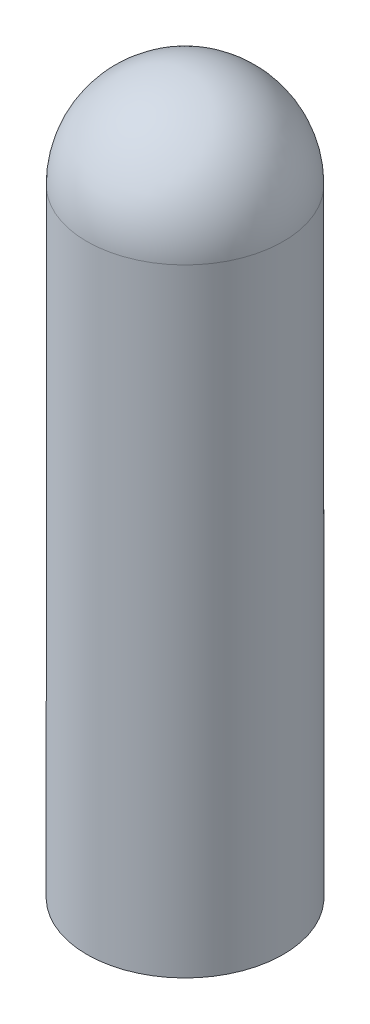
ISO-10303-21;
HEADER;
FILE_DESCRIPTION(('STEP AP214'),'2;1');
FILE_NAME('part.step','',(''),(''),'','','');
FILE_SCHEMA(('AUTOMOTIVE_DESIGN { 1 0 10303 214 1 1 1 1 }'));
ENDSEC;
DATA;
#1=APPLICATION_CONTEXT('core data for automotive mechanical design processes');
#2=APPLICATION_PROTOCOL_DEFINITION('international standard','automotive_design',2000,#1);
#3=PRODUCT_CONTEXT('',#1,'mechanical');
#4=PRODUCT('Part','Part','',(#3));
#5=PRODUCT_RELATED_PRODUCT_CATEGORY('part','',(#4));
#6=PRODUCT_DEFINITION_FORMATION('','',#4);
#7=PRODUCT_DEFINITION_CONTEXT('part definition',#1,'design');
#8=PRODUCT_DEFINITION('design','',#6,#7);
#9=PRODUCT_DEFINITION_SHAPE('','',#8);
#10=(LENGTH_UNIT() NAMED_UNIT(*) SI_UNIT(.MILLI.,.METRE.));
#11=(NAMED_UNIT(*) PLANE_ANGLE_UNIT() SI_UNIT($,.RADIAN.));
#12=(NAMED_UNIT(*) SI_UNIT($,.STERADIAN.) SOLID_ANGLE_UNIT());
#13=UNCERTAINTY_MEASURE_WITH_UNIT(LENGTH_MEASURE(1.E-05),#10,'distance_accuracy_value','');
#14=(GEOMETRIC_REPRESENTATION_CONTEXT(3) GLOBAL_UNCERTAINTY_ASSIGNED_CONTEXT((#13)) GLOBAL_UNIT_ASSIGNED_CONTEXT((#10,
#11,#12)) REPRESENTATION_CONTEXT('',''));
#15=CARTESIAN_POINT('',(0.,0.,0.));
#16=DIRECTION('',(0.,0.,1.));
#17=DIRECTION('',(1.,0.,0.));
#18=AXIS2_PLACEMENT_3D('',#15,#16,#17);
#19=CARTESIAN_POINT('',(-4.3561,0.,0.));
#20=DIRECTION('',(0.,-1.,0.));
#21=DIRECTION('',(0.,0.,-1.));
#22=AXIS2_PLACEMENT_3D('',#19,#20,#21);
#23=PLANE('',#22);
#24=CARTESIAN_POINT('',(0.,0.,0.));
#25=DIRECTION('',(0.,-1.,0.));
#26=DIRECTION('',(0.,0.,-1.));
#27=AXIS2_PLACEMENT_3D('',#24,#25,#26);
#28=CIRCLE('',#27,3.9751);
#29=CARTESIAN_POINT('',(0.,0.,-3.9751));
#30=VERTEX_POINT('',#29);
#31=EDGE_CURVE('E43',#30,#30,#28,.T.);
#32=ORIENTED_EDGE('',*,*,#31,.F.);
#33=EDGE_LOOP('',(#32));
#34=FACE_BOUND('',#33,.T.);
#35=CARTESIAN_POINT('',(0.,0.,0.));
#36=DIRECTION('',(0.,1.,0.));
#37=DIRECTION('',(0.,0.,1.));
#38=AXIS2_PLACEMENT_3D('',#35,#36,#37);
#39=CIRCLE('',#38,4.3561);
#40=CARTESIAN_POINT('',(0.,0.,4.3561));
#41=VERTEX_POINT('',#40);
#42=EDGE_CURVE('E10',#41,#41,#39,.T.);
#43=ORIENTED_EDGE('',*,*,#42,.F.);
#44=EDGE_LOOP('',(#43));
#45=FACE_BOUND('',#44,.T.);
#46=ADVANCED_FACE('F29',(#34,#45),#23,.T.);
#47=CARTESIAN_POINT('',(0.,0.,0.));
#48=DIRECTION('',(0.,1.,0.));
#49=DIRECTION('',(0.,0.,1.));
#50=AXIS2_PLACEMENT_3D('',#47,#48,#49);
#51=CYLINDRICAL_SURFACE('',#50,4.3561);
#52=ORIENTED_EDGE('',*,*,#42,.T.);
#53=EDGE_LOOP('',(#52));
#54=FACE_BOUND('',#53,.T.);
#55=CARTESIAN_POINT('',(0.,27.3939,0.));
#56=DIRECTION('',(0.,1.,0.));
#57=DIRECTION('',(0.,0.,1.));
#58=AXIS2_PLACEMENT_3D('',#55,#56,#57);
#59=CIRCLE('',#58,4.3561);
#60=CARTESIAN_POINT('',(0.,27.3939,4.3561));
#61=VERTEX_POINT('',#60);
#62=EDGE_CURVE('E35',#61,#61,#59,.T.);
#63=ORIENTED_EDGE('',*,*,#62,.F.);
#64=EDGE_LOOP('',(#63));
#65=FACE_BOUND('',#64,.T.);
#66=ADVANCED_FACE('F53',(#54,#65),#51,.T.);
#67=CARTESIAN_POINT('',(0.,27.3939,0.));
#68=DIRECTION('',(0.,1.,0.));
#69=DIRECTION('',(-1.,0.,0.));
#70=AXIS2_PLACEMENT_3D('',#67,#68,#69);
#71=SPHERICAL_SURFACE('',#70,4.3561);
#72=ORIENTED_EDGE('',*,*,#62,.T.);
#73=EDGE_LOOP('',(#72));
#74=FACE_BOUND('',#73,.T.);
#75=ADVANCED_FACE('F57',(#74),#71,.T.);
#76=CARTESIAN_POINT('',(0.,27.7749,0.));
#77=DIRECTION('',(0.,-1.,0.));
#78=DIRECTION('',(0.,0.,-1.));
#79=AXIS2_PLACEMENT_3D('',#76,#77,#78);
#80=CYLINDRICAL_SURFACE('',#79,3.9751);
#81=CARTESIAN_POINT('',(0.,27.7749,0.));
#82=DIRECTION('',(0.,-1.,0.));
#83=DIRECTION('',(0.,0.,-1.));
#84=AXIS2_PLACEMENT_3D('',#81,#82,#83);
#85=CIRCLE('',#84,3.9751);
#86=CARTESIAN_POINT('',(0.,27.7749,-3.9751));
#87=VERTEX_POINT('',#86);
#88=EDGE_CURVE('E39',#87,#87,#85,.T.);
#89=ORIENTED_EDGE('',*,*,#88,.F.);
#90=EDGE_LOOP('',(#89));
#91=FACE_BOUND('',#90,.T.);
#92=ORIENTED_EDGE('',*,*,#31,.T.);
#93=EDGE_LOOP('',(#92));
#94=FACE_BOUND('',#93,.T.);
#95=ADVANCED_FACE('F49',(#91,#94),#80,.F.);
#96=CARTESIAN_POINT('',(0.,27.7749,0.));
#97=DIRECTION('',(0.,-1.,0.));
#98=DIRECTION('',(0.,0.,-1.));
#99=AXIS2_PLACEMENT_3D('',#96,#97,#98);
#100=PLANE('',#99);
#101=ORIENTED_EDGE('',*,*,#88,.T.);
#102=EDGE_LOOP('',(#101));
#103=FACE_BOUND('',#102,.T.);
#104=ADVANCED_FACE('F66',(#103),#100,.T.);
#105=CLOSED_SHELL('',(#46,#66,#75,#95,#104));
#106=MANIFOLD_SOLID_BREP('B2',#105);
#107=ADVANCED_BREP_SHAPE_REPRESENTATION('',(#18,#106),#14);
#108=SHAPE_DEFINITION_REPRESENTATION(#9,#107);
ENDSEC;
END-ISO-10303-21;
